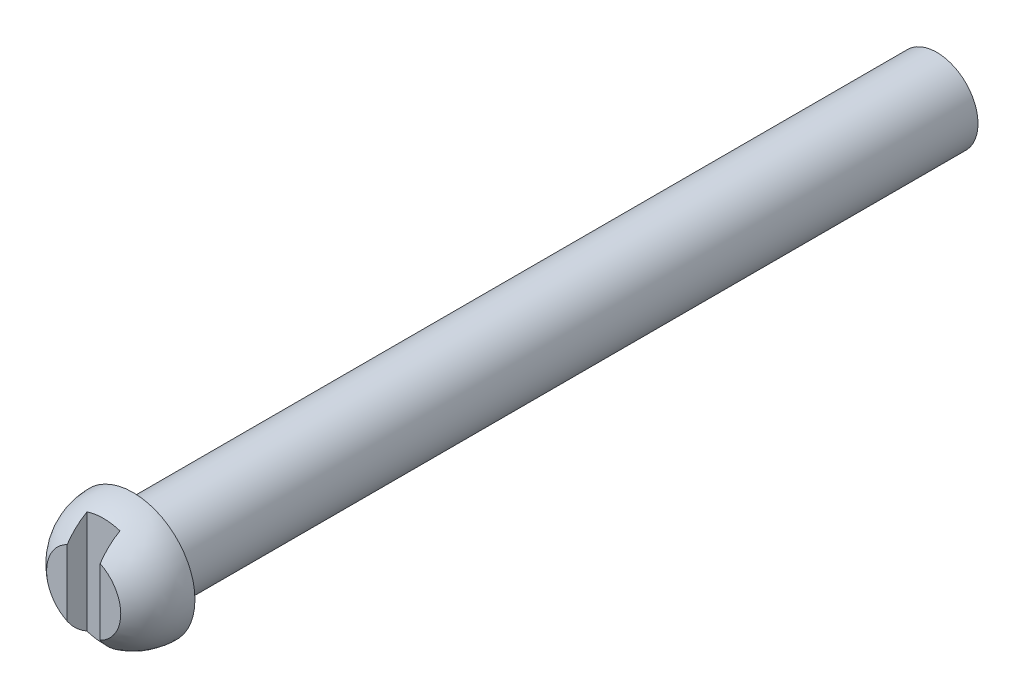
ISO-10303-21;
HEADER;
FILE_DESCRIPTION(('STEP AP214'),'2;1');
FILE_NAME('part.step','',(''),(''),'','','');
FILE_SCHEMA(('AUTOMOTIVE_DESIGN { 1 0 10303 214 1 1 1 1 }'));
ENDSEC;
DATA;
#1=APPLICATION_CONTEXT('core data for automotive mechanical design processes');
#2=APPLICATION_PROTOCOL_DEFINITION('international standard','automotive_design',2000,#1);
#3=PRODUCT_CONTEXT('',#1,'mechanical');
#4=PRODUCT('Part','Part','',(#3));
#5=PRODUCT_RELATED_PRODUCT_CATEGORY('part','',(#4));
#6=PRODUCT_DEFINITION_FORMATION('','',#4);
#7=PRODUCT_DEFINITION_CONTEXT('part definition',#1,'design');
#8=PRODUCT_DEFINITION('design','',#6,#7);
#9=PRODUCT_DEFINITION_SHAPE('','',#8);
#10=(LENGTH_UNIT() NAMED_UNIT(*) SI_UNIT(.MILLI.,.METRE.));
#11=(NAMED_UNIT(*) PLANE_ANGLE_UNIT() SI_UNIT($,.RADIAN.));
#12=(NAMED_UNIT(*) SI_UNIT($,.STERADIAN.) SOLID_ANGLE_UNIT());
#13=UNCERTAINTY_MEASURE_WITH_UNIT(LENGTH_MEASURE(1.E-05),#10,'distance_accuracy_value','');
#14=(GEOMETRIC_REPRESENTATION_CONTEXT(3) GLOBAL_UNCERTAINTY_ASSIGNED_CONTEXT((#13)) GLOBAL_UNIT_ASSIGNED_CONTEXT((#10,
#11,#12)) REPRESENTATION_CONTEXT('',''));
#15=CARTESIAN_POINT('',(0.,0.,0.));
#16=DIRECTION('',(0.,0.,1.));
#17=DIRECTION('',(1.,0.,0.));
#18=AXIS2_PLACEMENT_3D('',#15,#16,#17);
#19=CARTESIAN_POINT('',(10.922,4.7625,19.685));
#20=DIRECTION('',(0.,0.,1.));
#21=DIRECTION('',(1.,0.,0.));
#22=AXIS2_PLACEMENT_3D('',#19,#20,#21);
#23=PLANE('',#22);
#24=DIRECTION('',(0.,1.,0.));
#25=VECTOR('',#24,1.);
#26=CARTESIAN_POINT('',(1.27,4.7625,19.685));
#27=LINE('',#26,#25);
#28=CARTESIAN_POINT('',(1.27,-2.55976683508479,19.685));
#29=VERTEX_POINT('',#28);
#30=CARTESIAN_POINT('',(1.27,2.55976683508479,19.685));
#31=VERTEX_POINT('',#30);
#32=EDGE_CURVE('E80',#29,#31,#27,.T.);
#33=ORIENTED_EDGE('',*,*,#32,.F.);
#34=CARTESIAN_POINT('',(0.,0.,19.685));
#35=DIRECTION('',(0.,0.,1.));
#36=DIRECTION('',(1.,0.,0.));
#37=AXIS2_PLACEMENT_3D('',#34,#35,#36);
#38=CIRCLE('',#37,2.8575);
#39=EDGE_CURVE('E93',#29,#31,#38,.T.);
#40=ORIENTED_EDGE('',*,*,#39,.T.);
#41=EDGE_LOOP('',(#33,#40));
#42=FACE_BOUND('',#41,.T.);
#43=ADVANCED_FACE('F32',(#42),#23,.T.);
#44=CARTESIAN_POINT('',(0.,0.,15.875));
#45=DIRECTION('',(0.,1.,0.));
#46=DIRECTION('',(-1.,0.,0.));
#47=AXIS2_PLACEMENT_3D('',#44,#45,#46);
#48=SPHERICAL_SURFACE('',#47,4.7625);
#49=CARTESIAN_POINT('',(0.,0.,18.161));
#50=DIRECTION('',(0.,0.,-1.));
#51=DIRECTION('',(-1.,0.,0.));
#52=AXIS2_PLACEMENT_3D('',#49,#50,#51);
#53=CIRCLE('',#52,4.17799117399738);
#54=CARTESIAN_POINT('',(-1.27,3.98029022183056,18.161));
#55=VERTEX_POINT('',#54);
#56=CARTESIAN_POINT('',(1.27,3.98029022183056,18.161));
#57=VERTEX_POINT('',#56);
#58=EDGE_CURVE('E11',#55,#57,#53,.T.);
#59=ORIENTED_EDGE('',*,*,#58,.T.);
#60=CARTESIAN_POINT('',(1.27,0.,15.875));
#61=DIRECTION('',(1.,0.,0.));
#62=DIRECTION('',(0.,1.,0.));
#63=AXIS2_PLACEMENT_3D('',#60,#61,#62);
#64=CIRCLE('',#63,4.5900442535993);
#65=EDGE_CURVE('E55',#57,#31,#64,.T.);
#66=ORIENTED_EDGE('',*,*,#65,.T.);
#67=ORIENTED_EDGE('',*,*,#39,.F.);
#68=CARTESIAN_POINT('',(1.27,-3.98029022183056,18.161));
#69=VERTEX_POINT('',#68);
#70=EDGE_CURVE('E89',#29,#69,#64,.T.);
#71=ORIENTED_EDGE('',*,*,#70,.T.);
#72=CARTESIAN_POINT('',(-1.27,-3.98029022183056,18.161));
#73=VERTEX_POINT('',#72);
#74=EDGE_CURVE('E36',#69,#73,#53,.T.);
#75=ORIENTED_EDGE('',*,*,#74,.T.);
#76=CARTESIAN_POINT('',(-1.27,0.,15.875));
#77=DIRECTION('',(-1.,0.,0.));
#78=DIRECTION('',(0.,-1.,0.));
#79=AXIS2_PLACEMENT_3D('',#76,#77,#78);
#80=CIRCLE('',#79,4.5900442535993);
#81=CARTESIAN_POINT('',(-1.27,-2.55976683508479,19.685));
#82=VERTEX_POINT('',#81);
#83=EDGE_CURVE('E75',#73,#82,#80,.T.);
#84=ORIENTED_EDGE('',*,*,#83,.T.);
#85=CARTESIAN_POINT('',(-1.27,2.55976683508479,19.685));
#86=VERTEX_POINT('',#85);
#87=EDGE_CURVE('E87',#86,#82,#38,.T.);
#88=ORIENTED_EDGE('',*,*,#87,.F.);
#89=EDGE_CURVE('E47',#86,#55,#80,.T.);
#90=ORIENTED_EDGE('',*,*,#89,.T.);
#91=EDGE_LOOP('',(#59,#66,#67,#71,#75,#84,#88,#90));
#92=FACE_BOUND('',#91,.T.);
#93=CARTESIAN_POINT('',(0.,0.,15.875));
#94=DIRECTION('',(0.,0.,-1.));
#95=DIRECTION('',(-1.,0.,0.));
#96=AXIS2_PLACEMENT_3D('',#93,#94,#95);
#97=CIRCLE('',#96,4.7625);
#98=CARTESIAN_POINT('',(-4.7625,0.,15.875));
#99=VERTEX_POINT('',#98);
#100=EDGE_CURVE('E92',#99,#99,#97,.T.);
#101=ORIENTED_EDGE('',*,*,#100,.F.);
#102=EDGE_LOOP('',(#101));
#103=FACE_BOUND('',#102,.T.);
#104=ADVANCED_FACE('F85',(#92,#103),#48,.T.);
#105=CARTESIAN_POINT('',(0.,0.,-46.0375));
#106=DIRECTION('',(0.,0.,1.));
#107=DIRECTION('',(1.,0.,0.));
#108=AXIS2_PLACEMENT_3D('',#105,#106,#107);
#109=CYLINDRICAL_SURFACE('',#108,3.175);
#110=CARTESIAN_POINT('',(0.,0.,-46.0375));
#111=DIRECTION('',(0.,0.,1.));
#112=DIRECTION('',(1.,0.,0.));
#113=AXIS2_PLACEMENT_3D('',#110,#111,#112);
#114=CIRCLE('',#113,3.175);
#115=CARTESIAN_POINT('',(3.175,0.,-46.0375));
#116=VERTEX_POINT('',#115);
#117=EDGE_CURVE('E81',#116,#116,#114,.T.);
#118=ORIENTED_EDGE('',*,*,#117,.T.);
#119=EDGE_LOOP('',(#118));
#120=FACE_BOUND('',#119,.T.);
#121=CARTESIAN_POINT('',(0.,0.,15.875));
#122=DIRECTION('',(0.,0.,1.));
#123=DIRECTION('',(1.,0.,0.));
#124=AXIS2_PLACEMENT_3D('',#121,#122,#123);
#125=CIRCLE('',#124,3.175);
#126=CARTESIAN_POINT('',(3.175,0.,15.875));
#127=VERTEX_POINT('',#126);
#128=EDGE_CURVE('E96',#127,#127,#125,.T.);
#129=ORIENTED_EDGE('',*,*,#128,.F.);
#130=EDGE_LOOP('',(#129));
#131=FACE_BOUND('',#130,.T.);
#132=ADVANCED_FACE('F34',(#120,#131),#109,.T.);
#133=CARTESIAN_POINT('',(0.,0.,-46.0375));
#134=DIRECTION('',(0.,0.,1.));
#135=DIRECTION('',(1.,0.,0.));
#136=AXIS2_PLACEMENT_3D('',#133,#134,#135);
#137=PLANE('',#136);
#138=ORIENTED_EDGE('',*,*,#117,.F.);
#139=EDGE_LOOP('',(#138));
#140=FACE_BOUND('',#139,.T.);
#141=ADVANCED_FACE('F123',(#140),#137,.F.);
#142=CARTESIAN_POINT('',(0.,0.,15.875));
#143=DIRECTION('',(0.,0.,-1.));
#144=DIRECTION('',(-1.,0.,0.));
#145=AXIS2_PLACEMENT_3D('',#142,#143,#144);
#146=PLANE('',#145);
#147=ORIENTED_EDGE('',*,*,#128,.T.);
#148=EDGE_LOOP('',(#147));
#149=FACE_BOUND('',#148,.T.);
#150=ORIENTED_EDGE('',*,*,#100,.T.);
#151=EDGE_LOOP('',(#150));
#152=FACE_BOUND('',#151,.T.);
#153=ADVANCED_FACE('F116',(#149,#152),#146,.T.);
#154=DIRECTION('',(0.,-1.,0.));
#155=VECTOR('',#154,1.);
#156=CARTESIAN_POINT('',(-1.27,4.7625,19.685));
#157=LINE('',#156,#155);
#158=EDGE_CURVE('E72',#86,#82,#157,.T.);
#159=ORIENTED_EDGE('',*,*,#158,.F.);
#160=ORIENTED_EDGE('',*,*,#87,.T.);
#161=EDGE_LOOP('',(#159,#160));
#162=FACE_BOUND('',#161,.T.);
#163=ADVANCED_FACE('F91',(#162),#23,.T.);
#164=CARTESIAN_POINT('',(0.,0.,18.161));
#165=DIRECTION('',(0.,0.,-1.));
#166=DIRECTION('',(-1.,0.,0.));
#167=AXIS2_PLACEMENT_3D('',#164,#165,#166);
#168=PLANE('',#167);
#169=DIRECTION('',(0.,-1.,0.));
#170=VECTOR('',#169,1.);
#171=CARTESIAN_POINT('',(-1.27,5.61311796557698,18.161));
#172=LINE('',#171,#170);
#173=EDGE_CURVE('E136',#55,#73,#172,.T.);
#174=ORIENTED_EDGE('',*,*,#173,.T.);
#175=ORIENTED_EDGE('',*,*,#74,.F.);
#176=DIRECTION('',(0.,1.,0.));
#177=VECTOR('',#176,1.);
#178=CARTESIAN_POINT('',(1.27,5.61311796557698,18.161));
#179=LINE('',#178,#177);
#180=EDGE_CURVE('E138',#69,#57,#179,.T.);
#181=ORIENTED_EDGE('',*,*,#180,.T.);
#182=ORIENTED_EDGE('',*,*,#58,.F.);
#183=EDGE_LOOP('',(#174,#175,#181,#182));
#184=FACE_BOUND('',#183,.T.);
#185=ADVANCED_FACE('F115',(#184),#168,.F.);
#186=CARTESIAN_POINT('',(1.27,5.61311796557698,18.161));
#187=DIRECTION('',(1.,0.,0.));
#188=DIRECTION('',(0.,1.,0.));
#189=AXIS2_PLACEMENT_3D('',#186,#187,#188);
#190=PLANE('',#189);
#191=ORIENTED_EDGE('',*,*,#180,.F.);
#192=ORIENTED_EDGE('',*,*,#70,.F.);
#193=ORIENTED_EDGE('',*,*,#32,.T.);
#194=ORIENTED_EDGE('',*,*,#65,.F.);
#195=EDGE_LOOP('',(#191,#192,#193,#194));
#196=FACE_BOUND('',#195,.T.);
#197=ADVANCED_FACE('F102',(#196),#190,.F.);
#198=CARTESIAN_POINT('',(-1.27,5.61311796557698,18.161));
#199=DIRECTION('',(-1.,0.,0.));
#200=DIRECTION('',(0.,-1.,0.));
#201=AXIS2_PLACEMENT_3D('',#198,#199,#200);
#202=PLANE('',#201);
#203=ORIENTED_EDGE('',*,*,#173,.F.);
#204=ORIENTED_EDGE('',*,*,#89,.F.);
#205=ORIENTED_EDGE('',*,*,#158,.T.);
#206=ORIENTED_EDGE('',*,*,#83,.F.);
#207=EDGE_LOOP('',(#203,#204,#205,#206));
#208=FACE_BOUND('',#207,.T.);
#209=ADVANCED_FACE('F74',(#208),#202,.F.);
#210=CLOSED_SHELL('',(#43,#104,#132,#141,#153,#163,#185,#197,#209));
#211=MANIFOLD_SOLID_BREP('B2',#210);
#212=ADVANCED_BREP_SHAPE_REPRESENTATION('',(#18,#211),#14);
#213=SHAPE_DEFINITION_REPRESENTATION(#9,#212);
ENDSEC;
END-ISO-10303-21;
